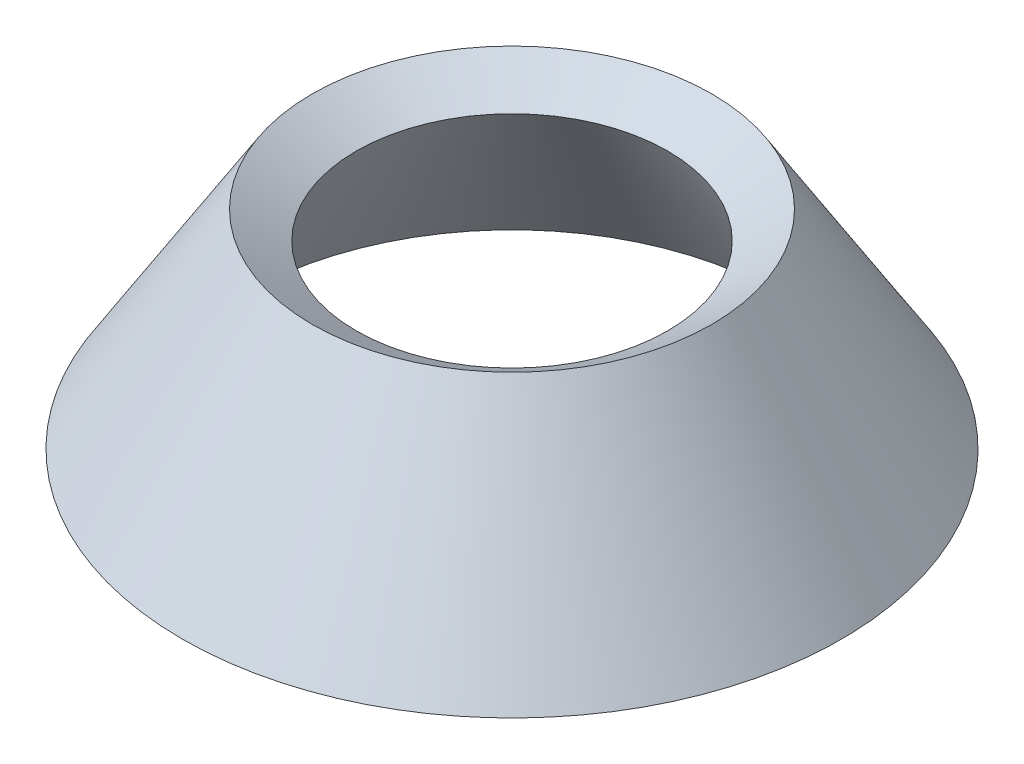
ISO-10303-21;
HEADER;
FILE_DESCRIPTION(('STEP AP214'),'2;1');
FILE_NAME('part.step','',(''),(''),'','','');
FILE_SCHEMA(('AUTOMOTIVE_DESIGN { 1 0 10303 214 1 1 1 1 }'));
ENDSEC;
DATA;
#1=APPLICATION_CONTEXT('core data for automotive mechanical design processes');
#2=APPLICATION_PROTOCOL_DEFINITION('international standard','automotive_design',2000,#1);
#3=PRODUCT_CONTEXT('',#1,'mechanical');
#4=PRODUCT('Part','Part','',(#3));
#5=PRODUCT_RELATED_PRODUCT_CATEGORY('part','',(#4));
#6=PRODUCT_DEFINITION_FORMATION('','',#4);
#7=PRODUCT_DEFINITION_CONTEXT('part definition',#1,'design');
#8=PRODUCT_DEFINITION('design','',#6,#7);
#9=PRODUCT_DEFINITION_SHAPE('','',#8);
#10=(LENGTH_UNIT() NAMED_UNIT(*) SI_UNIT(.MILLI.,.METRE.));
#11=(NAMED_UNIT(*) PLANE_ANGLE_UNIT() SI_UNIT($,.RADIAN.));
#12=(NAMED_UNIT(*) SI_UNIT($,.STERADIAN.) SOLID_ANGLE_UNIT());
#13=UNCERTAINTY_MEASURE_WITH_UNIT(LENGTH_MEASURE(1.E-05),#10,'distance_accuracy_value','');
#14=(GEOMETRIC_REPRESENTATION_CONTEXT(3) GLOBAL_UNCERTAINTY_ASSIGNED_CONTEXT((#13)) GLOBAL_UNIT_ASSIGNED_CONTEXT((#10,
#11,#12)) REPRESENTATION_CONTEXT('',''));
#15=CARTESIAN_POINT('',(0.,0.,0.));
#16=DIRECTION('',(0.,0.,1.));
#17=DIRECTION('',(1.,0.,0.));
#18=AXIS2_PLACEMENT_3D('',#15,#16,#17);
#19=CARTESIAN_POINT('',(0.,5.2999894000318,0.));
#20=DIRECTION('',(0.,-1.,0.));
#21=DIRECTION('',(0.,0.,-1.));
#22=AXIS2_PLACEMENT_3D('',#19,#20,#21);
#23=CONICAL_SURFACE('',#22,63.4799830400509,0.558599315343563);
#24=CARTESIAN_POINT('',(0.,45.2999894000318,0.));
#25=DIRECTION('',(0.,-1.,0.));
#26=DIRECTION('',(0.,0.,-1.));
#27=AXIS2_PLACEMENT_3D('',#24,#25,#26);
#28=CIRCLE('',#27,38.4799830400509);
#29=CARTESIAN_POINT('',(0.,45.2999894000318,-38.4799830400509));
#30=VERTEX_POINT('',#29);
#31=EDGE_CURVE('E38',#30,#30,#28,.T.);
#32=ORIENTED_EDGE('',*,*,#31,.T.);
#33=EDGE_LOOP('',(#32));
#34=FACE_BOUND('',#33,.T.);
#35=CARTESIAN_POINT('',(0.,5.2999894000318,0.));
#36=DIRECTION('',(0.,1.,0.));
#37=DIRECTION('',(0.,0.,1.));
#38=AXIS2_PLACEMENT_3D('',#35,#36,#37);
#39=CIRCLE('',#38,63.4799830400509);
#40=CARTESIAN_POINT('',(0.,5.2999894000318,63.4799830400509));
#41=VERTEX_POINT('',#40);
#42=EDGE_CURVE('E42',#41,#41,#39,.T.);
#43=ORIENTED_EDGE('',*,*,#42,.T.);
#44=EDGE_LOOP('',(#43));
#45=FACE_BOUND('',#44,.T.);
#46=ADVANCED_FACE('F31',(#34,#45),#23,.T.);
#47=CARTESIAN_POINT('',(0.,0.,0.));
#48=DIRECTION('',(0.,-1.,0.));
#49=DIRECTION('',(0.,0.,-1.));
#50=AXIS2_PLACEMENT_3D('',#47,#48,#49);
#51=CONICAL_SURFACE('',#50,55.,0.558599315343562);
#52=CARTESIAN_POINT('',(0.,5.2999894000318,0.));
#53=DIRECTION('',(0.,1.,0.));
#54=DIRECTION('',(0.,0.,1.));
#55=AXIS2_PLACEMENT_3D('',#52,#53,#54);
#56=CIRCLE('',#55,51.6875066249801);
#57=CARTESIAN_POINT('',(0.,5.2999894000318,51.6875066249801));
#58=VERTEX_POINT('',#57);
#59=EDGE_CURVE('E34',#58,#58,#56,.F.);
#60=ORIENTED_EDGE('',*,*,#59,.T.);
#61=EDGE_LOOP('',(#60));
#62=FACE_BOUND('',#61,.T.);
#63=CARTESIAN_POINT('',(0.,40.,0.));
#64=DIRECTION('',(0.,-1.,0.));
#65=DIRECTION('',(0.,0.,-1.));
#66=AXIS2_PLACEMENT_3D('',#63,#64,#65);
#67=CIRCLE('',#66,30.);
#68=CARTESIAN_POINT('',(0.,40.,-30.));
#69=VERTEX_POINT('',#68);
#70=EDGE_CURVE('E10',#69,#69,#67,.T.);
#71=ORIENTED_EDGE('',*,*,#70,.F.);
#72=EDGE_LOOP('',(#71));
#73=FACE_BOUND('',#72,.T.);
#74=ADVANCED_FACE('F51',(#62,#73),#51,.F.);
#75=CARTESIAN_POINT('',(0.,40.,0.));
#76=DIRECTION('',(0.,1.,0.));
#77=DIRECTION('',(0.,0.,1.));
#78=AXIS2_PLACEMENT_3D('',#75,#76,#77);
#79=CONICAL_SURFACE('',#78,30.,1.01219701145133);
#80=ORIENTED_EDGE('',*,*,#31,.F.);
#81=EDGE_LOOP('',(#80));
#82=FACE_BOUND('',#81,.T.);
#83=ORIENTED_EDGE('',*,*,#70,.T.);
#84=EDGE_LOOP('',(#83));
#85=FACE_BOUND('',#84,.T.);
#86=ADVANCED_FACE('F57',(#82,#85),#79,.F.);
#87=CARTESIAN_POINT('',(0.,5.2999894000318,0.));
#88=DIRECTION('',(0.,1.,0.));
#89=DIRECTION('',(0.,0.,1.));
#90=AXIS2_PLACEMENT_3D('',#87,#88,#89);
#91=PLANE('',#90);
#92=ORIENTED_EDGE('',*,*,#59,.F.);
#93=EDGE_LOOP('',(#92));
#94=FACE_BOUND('',#93,.T.);
#95=ORIENTED_EDGE('',*,*,#42,.F.);
#96=EDGE_LOOP('',(#95));
#97=FACE_BOUND('',#96,.T.);
#98=ADVANCED_FACE('F54',(#94,#97),#91,.F.);
#99=CLOSED_SHELL('',(#46,#74,#86,#98));
#100=MANIFOLD_SOLID_BREP('B2',#99);
#101=ADVANCED_BREP_SHAPE_REPRESENTATION('',(#18,#100),#14);
#102=SHAPE_DEFINITION_REPRESENTATION(#9,#101);
ENDSEC;
END-ISO-10303-21;
